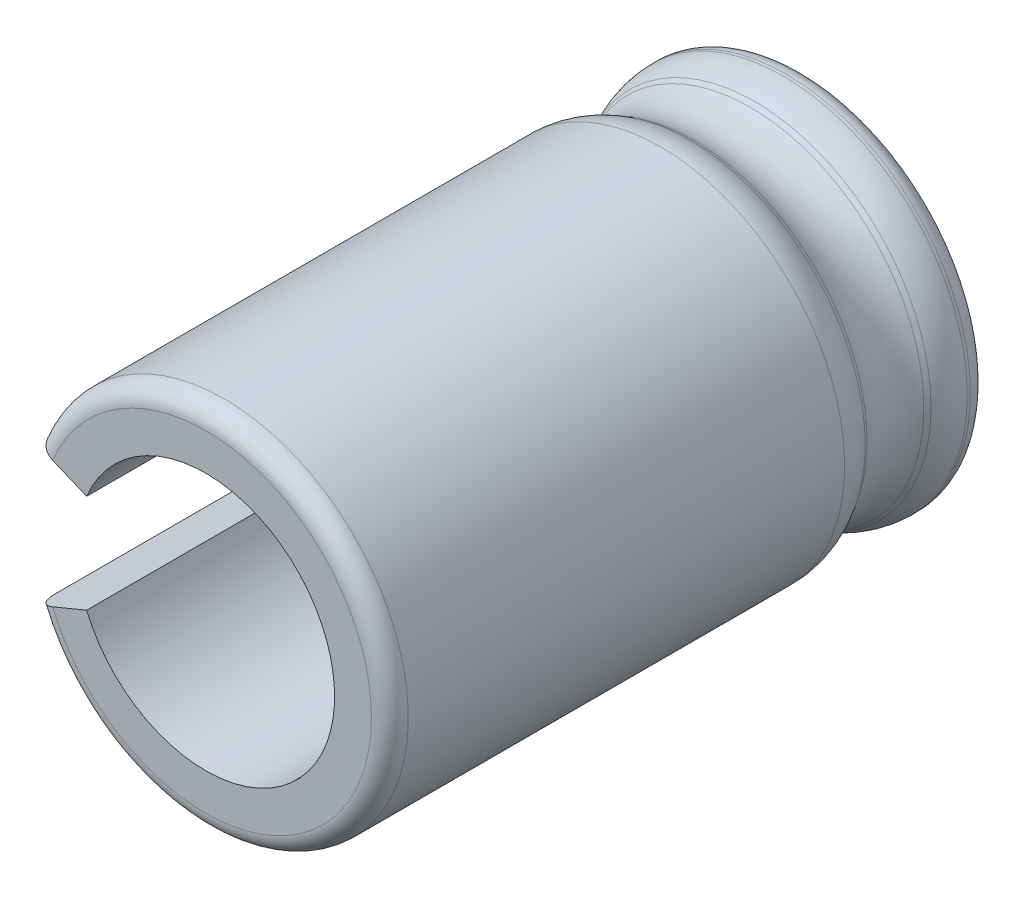
ISO-10303-21;
HEADER;
FILE_DESCRIPTION(('STEP AP214'),'2;1');
FILE_NAME('part.step','',(''),(''),'','','');
FILE_SCHEMA(('AUTOMOTIVE_DESIGN { 1 0 10303 214 1 1 1 1 }'));
ENDSEC;
DATA;
#1=APPLICATION_CONTEXT('core data for automotive mechanical design processes');
#2=APPLICATION_PROTOCOL_DEFINITION('international standard','automotive_design',2000,#1);
#3=PRODUCT_CONTEXT('',#1,'mechanical');
#4=PRODUCT('Part','Part','',(#3));
#5=PRODUCT_RELATED_PRODUCT_CATEGORY('part','',(#4));
#6=PRODUCT_DEFINITION_FORMATION('','',#4);
#7=PRODUCT_DEFINITION_CONTEXT('part definition',#1,'design');
#8=PRODUCT_DEFINITION('design','',#6,#7);
#9=PRODUCT_DEFINITION_SHAPE('','',#8);
#10=(LENGTH_UNIT() NAMED_UNIT(*) SI_UNIT(.MILLI.,.METRE.));
#11=(NAMED_UNIT(*) PLANE_ANGLE_UNIT() SI_UNIT($,.RADIAN.));
#12=(NAMED_UNIT(*) SI_UNIT($,.STERADIAN.) SOLID_ANGLE_UNIT());
#13=UNCERTAINTY_MEASURE_WITH_UNIT(LENGTH_MEASURE(1.E-05),#10,'distance_accuracy_value','');
#14=(GEOMETRIC_REPRESENTATION_CONTEXT(3) GLOBAL_UNCERTAINTY_ASSIGNED_CONTEXT((#13)) GLOBAL_UNIT_ASSIGNED_CONTEXT((#10,
#11,#12)) REPRESENTATION_CONTEXT('',''));
#15=CARTESIAN_POINT('',(0.,0.,0.));
#16=DIRECTION('',(0.,0.,1.));
#17=DIRECTION('',(1.,0.,0.));
#18=AXIS2_PLACEMENT_3D('',#15,#16,#17);
#19=CARTESIAN_POINT('',(0.,0.,0.42));
#20=DIRECTION('',(0.,0.,1.));
#21=DIRECTION('',(1.,0.,0.));
#22=AXIS2_PLACEMENT_3D('',#19,#20,#21);
#23=CYLINDRICAL_SURFACE('',#22,5.25);
#24=DIRECTION('',(0.,0.,1.));
#25=VECTOR('',#24,1.);
#26=CARTESIAN_POINT('',(-4.85036754568426,-2.00908801991671,0.42));
#27=LINE('',#26,#25);
#28=CARTESIAN_POINT('',(-4.85036754568426,-2.00908801991671,1.03375025520622));
#29=VERTEX_POINT('',#28);
#30=CARTESIAN_POINT('',(-4.85036754568426,-2.00908801991671,0.945));
#31=VERTEX_POINT('',#30);
#32=EDGE_CURVE('E102',#29,#31,#27,.F.);
#33=ORIENTED_EDGE('',*,*,#32,.T.);
#34=CARTESIAN_POINT('',(0.,0.,0.945));
#35=DIRECTION('',(0.,0.,1.));
#36=DIRECTION('',(1.,0.,0.));
#37=AXIS2_PLACEMENT_3D('',#34,#35,#36);
#38=CIRCLE('',#37,5.25);
#39=CARTESIAN_POINT('',(-4.85036754568426,2.00908801991671,0.945));
#40=VERTEX_POINT('',#39);
#41=EDGE_CURVE('E118',#40,#31,#38,.F.);
#42=ORIENTED_EDGE('',*,*,#41,.F.);
#43=DIRECTION('',(0.,0.,1.));
#44=VECTOR('',#43,1.);
#45=CARTESIAN_POINT('',(-4.85036754568426,2.00908801991671,0.42));
#46=LINE('',#45,#44);
#47=CARTESIAN_POINT('',(-4.85036754568426,2.00908801991671,1.03375025520622));
#48=VERTEX_POINT('',#47);
#49=EDGE_CURVE('E108',#40,#48,#46,.T.);
#50=ORIENTED_EDGE('',*,*,#49,.T.);
#51=CARTESIAN_POINT('',(0.,0.,1.03375025520622));
#52=DIRECTION('',(0.,0.,-1.));
#53=DIRECTION('',(1.,0.,0.));
#54=AXIS2_PLACEMENT_3D('',#51,#52,#53);
#55=CIRCLE('',#54,5.25);
#56=EDGE_CURVE('E159',#29,#48,#55,.F.);
#57=ORIENTED_EDGE('',*,*,#56,.F.);
#58=EDGE_LOOP('',(#33,#42,#50,#57));
#59=FACE_BOUND('',#58,.T.);
#60=ADVANCED_FACE('F17',(#59),#23,.T.);
#61=CARTESIAN_POINT('',(0.,0.,0.945));
#62=DIRECTION('',(0.,0.,1.));
#63=DIRECTION('',(1.,0.,0.));
#64=AXIS2_PLACEMENT_3D('',#61,#62,#63);
#65=TOROIDAL_SURFACE('',#64,4.725,0.525);
#66=CARTESIAN_POINT('',(-4.85036754568426,-2.00908801991671,0.945));
#67=CARTESIAN_POINT('',(-4.85039072116002,-2.00909761951308,0.915464391405059));
#68=CARTESIAN_POINT('',(-4.84806622229642,-2.00813478055806,0.885936277537769));
#69=CARTESIAN_POINT('',(-4.83889289537986,-2.00433506413714,0.827737923886833));
#70=CARTESIAN_POINT('',(-4.83204761711794,-2.00149965704285,0.799067029448648));
#71=CARTESIAN_POINT('',(-4.81399892411026,-1.99402364361596,0.743363719677459));
#72=CARTESIAN_POINT('',(-4.80279341672496,-1.98938217048369,0.716332098305048));
#73=CARTESIAN_POINT('',(-4.77635212953041,-1.9784298307211,0.664693094464665));
#74=CARTESIAN_POINT('',(-4.76111705970481,-1.97211925817564,0.640085285983271));
#75=CARTESIAN_POINT('',(-4.72704476589315,-1.95800605197769,0.593985045585103));
#76=CARTESIAN_POINT('',(-4.70820719582776,-1.95020327497445,0.572492913329232));
#77=CARTESIAN_POINT('',(-4.66746560106759,-1.93332755387208,0.533237078711865));
#78=CARTESIAN_POINT('',(-4.64556162580989,-1.92425463025045,0.515473316252535));
#79=CARTESIAN_POINT('',(-4.59930486040365,-1.90509445066768,0.484173774991626));
#80=CARTESIAN_POINT('',(-4.57495133392578,-1.89500688970893,0.470639272546676));
#81=CARTESIAN_POINT('',(-4.52449545169203,-1.87410737898621,0.448194865945521));
#82=CARTESIAN_POINT('',(-4.49839413036681,-1.86329585769745,0.439282253171321));
#83=CARTESIAN_POINT('',(-4.45433269969836,-1.84504501553701,0.428549553120101));
#84=CARTESIAN_POINT('',(-4.43664976944949,-1.83772050600544,0.425345407947885));
#85=CARTESIAN_POINT('',(-4.40109062734295,-1.82299142707856,0.421070913483755));
#86=CARTESIAN_POINT('',(-4.38321472577348,-1.81558698620883,0.419997539157893));
#87=CARTESIAN_POINT('',(-4.36533079111584,-1.80817921792504,0.42));
#88=B_SPLINE_CURVE_WITH_KNOTS('',3,(#66,#67,#68,#69,#70,#71,#72,#73,#74,#75,#76,#77,#78,#79,#80,
#81,#82,#83,#84,#85,#86,#87),.UNSPECIFIED.,.F.,.F.,(4,2,2,2,2,2,2,2,2,2,4),(0.,
0.088489114357564,0.176908828074504,0.265371030215084,0.353817656241403,0.442272783291248,
0.530726484417659,0.619206854434946,0.707635312539519,0.765743495319774,0.823769123330239),.UNSPECIFIED.);
#89=CARTESIAN_POINT('',(-4.36533079111583,-1.80817921792504,0.419999999999999));
#90=VERTEX_POINT('',#89);
#91=EDGE_CURVE('E121',#31,#90,#88,.T.);
#92=ORIENTED_EDGE('',*,*,#91,.T.);
#93=CARTESIAN_POINT('',(0.,0.,0.42));
#94=DIRECTION('',(0.,0.,1.));
#95=DIRECTION('',(-0.923879532511288,-0.382683432365088,0.));
#96=AXIS2_PLACEMENT_3D('',#93,#94,#95);
#97=CIRCLE('',#96,4.725);
#98=CARTESIAN_POINT('',(-4.36533079111583,1.80817921792504,0.419999999999999));
#99=VERTEX_POINT('',#98);
#100=EDGE_CURVE('E125',#90,#99,#97,.T.);
#101=ORIENTED_EDGE('',*,*,#100,.T.);
#102=CARTESIAN_POINT('',(-4.36533079111583,1.80817921792504,0.42));
#103=CARTESIAN_POINT('',(-4.39261813537696,1.81948200599915,0.419974915045805));
#104=CARTESIAN_POINT('',(-4.41989855541261,1.83078192596515,0.42249093448535));
#105=CARTESIAN_POINT('',(-4.47366682317657,1.85305347169828,0.432420071990567));
#106=CARTESIAN_POINT('',(-4.5001552757268,1.86402534799087,0.439829347790093));
#107=CARTESIAN_POINT('',(-4.55161842351754,1.8853420817682,0.459365112327077));
#108=CARTESIAN_POINT('',(-4.5765923852341,1.89568663541739,0.471493866121253));
#109=CARTESIAN_POINT('',(-4.6243006039615,1.91544802665094,0.500113709146317));
#110=CARTESIAN_POINT('',(-4.64703525455742,1.92486502726358,0.516604029896457));
#111=CARTESIAN_POINT('',(-4.68962632310514,1.94250682549201,0.55348361496427));
#112=CARTESIAN_POINT('',(-4.70948246420636,1.95073150843253,0.573873253875511));
#113=CARTESIAN_POINT('',(-4.74575012634099,1.96575406596426,0.617971638271388));
#114=CARTESIAN_POINT('',(-4.76216170289756,1.97255196355392,0.641680330245722));
#115=CARTESIAN_POINT('',(-4.79107870844551,1.9845297794351,0.691748292332195));
#116=CARTESIAN_POINT('',(-4.80358295823712,1.98970920928608,0.718108359441449));
#117=CARTESIAN_POINT('',(-4.82431888611529,1.99829831184161,0.772721412830135));
#118=CARTESIAN_POINT('',(-4.83255306663858,2.00170902108938,0.800973279449882));
#119=CARTESIAN_POINT('',(-4.84246878854448,2.00581624758352,0.84866502833913));
#120=CARTESIAN_POINT('',(-4.84542903268828,2.00704242085582,0.867804894118823));
#121=CARTESIAN_POINT('',(-4.84937815063553,2.00867819906899,0.906293832184031));
#122=CARTESIAN_POINT('',(-4.85036981920591,2.00908896164022,0.925642568616026));
#123=CARTESIAN_POINT('',(-4.85036754568426,2.00908801991672,0.944999999999993));
#124=B_SPLINE_CURVE_WITH_KNOTS('',3,(#102,#103,#104,#105,#106,#107,#108,#109,#110,#111,#112,
#113,#114,#115,#116,#117,#118,#119,#120,#121,#122,#123),.UNSPECIFIED.,.F.,.F.,(4,2,2,2,2,2,2,2,
2,2,4),(0.,0.0884891143575641,0.176908828074504,0.265371030215085,0.353817656241405,
0.442272783291249,0.53072648441766,0.619206854434946,0.707635312539518,0.765743495319774,
0.823769123330239),.UNSPECIFIED.);
#125=EDGE_CURVE('E111',#99,#40,#124,.T.);
#126=ORIENTED_EDGE('',*,*,#125,.T.);
#127=ORIENTED_EDGE('',*,*,#41,.T.);
#128=EDGE_LOOP('',(#92,#101,#126,#127));
#129=FACE_BOUND('',#128,.T.);
#130=ADVANCED_FACE('F123',(#129),#65,.T.);
#131=CARTESIAN_POINT('',(0.,0.,1.03375025520622));
#132=DIRECTION('',(0.,0.,-1.));
#133=DIRECTION('',(1.,0.,0.));
#134=AXIS2_PLACEMENT_3D('',#131,#132,#133);
#135=TOROIDAL_SURFACE('',#134,3.675,1.575);
#136=CARTESIAN_POINT('',(-4.6430040392502,-1.92319524321049,1.84408106998251));
#137=CARTESIAN_POINT('',(-4.6642930980392,-1.93201346009105,1.80567264401115));
#138=CARTESIAN_POINT('',(-4.68405717686441,-1.94020000958826,1.76630490989179));
#139=CARTESIAN_POINT('',(-4.72042309678055,-1.9552632668257,1.6858823007809));
#140=CARTESIAN_POINT('',(-4.73702417512244,-1.96213965862493,1.64482702173695));
#141=CARTESIAN_POINT('',(-4.78120533193521,-1.98044009297811,1.52144596809976));
#142=CARTESIAN_POINT('',(-4.80415967611481,-1.98994809365269,1.43709672178333));
#143=CARTESIAN_POINT('',(-4.83034396301765,-2.00079398040891,1.29949087476157));
#144=CARTESIAN_POINT('',(-4.83778357186439,-2.00387556729198,1.24711280320819));
#145=CARTESIAN_POINT('',(-4.84782961323955,-2.00803677387773,1.14108991509009));
#146=CARTESIAN_POINT('',(-4.8503683474684,-2.00908835202658,1.08743757789838));
#147=CARTESIAN_POINT('',(-4.85036754568426,-2.00908801991672,1.03375025520623));
#148=B_SPLINE_CURVE_WITH_KNOTS('',3,(#136,#137,#138,#139,#140,#141,#142,#143,#144,#145,#146,
#147),.UNSPECIFIED.,.F.,.F.,(4,2,2,2,2,4),(0.,0.134277866281074,0.268588072437448,
0.530970445713372,0.689715228986294,0.850637571564519),.UNSPECIFIED.);
#149=CARTESIAN_POINT('',(-4.64300403926542,-1.92319524320921,1.84408106997915));
#150=VERTEX_POINT('',#149);
#151=EDGE_CURVE('E166',#150,#29,#148,.T.);
#152=ORIENTED_EDGE('',*,*,#151,.T.);
#153=ORIENTED_EDGE('',*,*,#56,.T.);
#154=CARTESIAN_POINT('',(-4.85036754568426,2.00908801991671,1.03375025520622));
#155=CARTESIAN_POINT('',(-4.8503660052936,2.00908738186601,1.07854079166082));
#156=CARTESIAN_POINT('',(-4.84860081541753,2.00835621627918,1.12330468777989));
#157=CARTESIAN_POINT('',(-4.8415568869684,2.00543852558317,1.2125181848482));
#158=CARTESIAN_POINT('',(-4.83627730228437,2.00325165000334,1.25696770750513));
#159=CARTESIAN_POINT('',(-4.81551535662384,1.9946517705295,1.38736996437547));
#160=CARTESIAN_POINT('',(-4.79510464015692,1.98619737495115,1.47248180371879));
#161=CARTESIAN_POINT('',(-4.75214900498053,1.96840456828074,1.60505951192081));
#162=CARTESIAN_POINT('',(-4.73363143829658,1.9607343410181,1.6541163531869));
#163=CARTESIAN_POINT('',(-4.6918497658631,1.94342780563752,1.75062473144622));
#164=CARTESIAN_POINT('',(-4.66852403450519,1.9337659713568,1.7980450170756));
#165=CARTESIAN_POINT('',(-4.64300403925021,1.92319524321049,1.8440810699825));
#166=B_SPLINE_CURVE_WITH_KNOTS('',3,(#154,#155,#156,#157,#158,#159,#160,#161,#162,#163,#164,
#165),.UNSPECIFIED.,.F.,.F.,(4,2,2,2,2,4),(0.,0.134277866281075,0.268588072437449,
0.530970445713373,0.689715228986294,0.85063757156452),.UNSPECIFIED.);
#167=CARTESIAN_POINT('',(-4.64300403926542,1.92319524320922,1.84408106997915));
#168=VERTEX_POINT('',#167);
#169=EDGE_CURVE('E114',#48,#168,#166,.T.);
#170=ORIENTED_EDGE('',*,*,#169,.T.);
#171=CARTESIAN_POINT('',(0.,0.,1.8440810699758));
#172=DIRECTION('',(0.,0.,-1.));
#173=DIRECTION('',(-1.,0.,0.));
#174=AXIS2_PLACEMENT_3D('',#171,#172,#173);
#175=CIRCLE('',#174,5.02555135801686);
#176=EDGE_CURVE('E155',#150,#168,#175,.F.);
#177=ORIENTED_EDGE('',*,*,#176,.F.);
#178=EDGE_LOOP('',(#152,#153,#170,#177));
#179=FACE_BOUND('',#178,.T.);
#180=ADVANCED_FACE('F146',(#179),#135,.T.);
#181=CARTESIAN_POINT('',(0.,0.,0.42));
#182=DIRECTION('',(0.,0.,1.));
#183=DIRECTION('',(1.,0.,0.));
#184=AXIS2_PLACEMENT_3D('',#181,#182,#183);
#185=PLANE('',#184);
#186=ORIENTED_EDGE('',*,*,#100,.F.);
#187=DIRECTION('',(-0.923879532511288,-0.382683432365087,0.));
#188=VECTOR('',#187,1.);
#189=CARTESIAN_POINT('',(-3.39525728197898,-1.4063616139417,0.42));
#190=LINE('',#189,#188);
#191=CARTESIAN_POINT('',(-3.39525728197898,-1.4063616139417,0.419999999999998));
#192=VERTEX_POINT('',#191);
#193=EDGE_CURVE('E165',#192,#90,#190,.T.);
#194=ORIENTED_EDGE('',*,*,#193,.F.);
#195=CARTESIAN_POINT('',(0.,0.,0.419999999999998));
#196=DIRECTION('',(0.,0.,1.));
#197=DIRECTION('',(1.,0.,0.));
#198=AXIS2_PLACEMENT_3D('',#195,#196,#197);
#199=CIRCLE('',#198,3.675);
#200=CARTESIAN_POINT('',(-3.39525728197898,1.4063616139417,0.419999999999998));
#201=VERTEX_POINT('',#200);
#202=EDGE_CURVE('E287',#192,#201,#199,.T.);
#203=ORIENTED_EDGE('',*,*,#202,.T.);
#204=DIRECTION('',(0.923879532511288,-0.382683432365087,0.));
#205=VECTOR('',#204,1.);
#206=CARTESIAN_POINT('',(-4.36533079111583,1.80817921792504,0.42));
#207=LINE('',#206,#205);
#208=EDGE_CURVE('E241',#99,#201,#207,.T.);
#209=ORIENTED_EDGE('',*,*,#208,.F.);
#210=EDGE_LOOP('',(#186,#194,#203,#209));
#211=FACE_BOUND('',#210,.T.);
#212=ADVANCED_FACE('F250',(#211),#185,.F.);
#213=CARTESIAN_POINT('',(0.,0.,1.8440810699758));
#214=DIRECTION('',(0.,0.,-1.));
#215=DIRECTION('',(-1.,0.,0.));
#216=AXIS2_PLACEMENT_3D('',#213,#214,#215);
#217=CONICAL_SURFACE('',#216,5.02555135801686,0.540419500335847);
#218=DIRECTION('',(0.475332098003425,0.196889001624275,0.857492925712544));
#219=VECTOR('',#218,1.);
#220=CARTESIAN_POINT('',(-276615.197263173,-114577.766264915,-499000.));
#221=LINE('',#220,#219);
#222=CARTESIAN_POINT('',(-4.57200124648011,-1.89378492347292,1.97216918516948));
#223=VERTEX_POINT('',#222);
#224=EDGE_CURVE('E240',#223,#150,#221,.F.);
#225=ORIENTED_EDGE('',*,*,#224,.T.);
#226=ORIENTED_EDGE('',*,*,#176,.T.);
#227=DIRECTION('',(0.475332098003425,-0.196889001624275,0.857492925712544));
#228=VECTOR('',#227,1.);
#229=CARTESIAN_POINT('',(-276615.197263173,114577.766264915,-499000.));
#230=LINE('',#229,#228);
#231=CARTESIAN_POINT('',(-4.57200124648011,1.89378492347292,1.97216918516948));
#232=VERTEX_POINT('',#231);
#233=EDGE_CURVE('E238',#168,#232,#230,.T.);
#234=ORIENTED_EDGE('',*,*,#233,.T.);
#235=CARTESIAN_POINT('',(0.,0.,1.97216918520165));
#236=DIRECTION('',(0.,0.,-1.));
#237=DIRECTION('',(1.,0.,0.));
#238=AXIS2_PLACEMENT_3D('',#235,#236,#237);
#239=CIRCLE('',#238,4.94869848887901);
#240=EDGE_CURVE('E307',#232,#223,#239,.T.);
#241=ORIENTED_EDGE('',*,*,#240,.T.);
#242=EDGE_LOOP('',(#225,#226,#234,#241));
#243=FACE_BOUND('',#242,.T.);
#244=ADVANCED_FACE('F259',(#243),#217,.T.);
#245=CARTESIAN_POINT('',(0.,0.,17.5));
#246=DIRECTION('',(0.,0.,1.));
#247=DIRECTION('',(1.,0.,0.));
#248=AXIS2_PLACEMENT_3D('',#245,#246,#247);
#249=PLANE('',#248);
#250=DIRECTION('',(-0.923879532511288,-0.382683432365087,0.));
#251=VECTOR('',#250,1.);
#252=CARTESIAN_POINT('',(-3.39525728197898,-1.4063616139417,17.5));
#253=LINE('',#252,#251);
#254=CARTESIAN_POINT('',(-3.39525728197898,-1.4063616139417,17.5));
#255=VERTEX_POINT('',#254);
#256=CARTESIAN_POINT('',(-4.36533079111583,-1.80817921792504,17.5));
#257=VERTEX_POINT('',#256);
#258=EDGE_CURVE('E277',#255,#257,#253,.T.);
#259=ORIENTED_EDGE('',*,*,#258,.T.);
#260=CARTESIAN_POINT('',(0.,0.,17.5));
#261=DIRECTION('',(0.,0.,-1.));
#262=DIRECTION('',(-0.923879532511288,0.382683432365088,0.));
#263=AXIS2_PLACEMENT_3D('',#260,#261,#262);
#264=CIRCLE('',#263,4.725);
#265=CARTESIAN_POINT('',(-4.36533079111583,1.80817921792504,17.5));
#266=VERTEX_POINT('',#265);
#267=EDGE_CURVE('E346',#266,#257,#264,.T.);
#268=ORIENTED_EDGE('',*,*,#267,.F.);
#269=DIRECTION('',(-0.923879532511287,0.38268343236509,0.));
#270=VECTOR('',#269,1.);
#271=CARTESIAN_POINT('',(-14.5,6.00609665440987,17.5));
#272=LINE('',#271,#270);
#273=CARTESIAN_POINT('',(-3.39525728197898,1.4063616139417,17.5));
#274=VERTEX_POINT('',#273);
#275=EDGE_CURVE('E237',#266,#274,#272,.F.);
#276=ORIENTED_EDGE('',*,*,#275,.T.);
#277=CARTESIAN_POINT('',(0.,0.,17.5));
#278=DIRECTION('',(0.,0.,1.));
#279=DIRECTION('',(1.,0.,0.));
#280=AXIS2_PLACEMENT_3D('',#277,#278,#279);
#281=CIRCLE('',#280,3.675);
#282=EDGE_CURVE('E284',#274,#255,#281,.F.);
#283=ORIENTED_EDGE('',*,*,#282,.T.);
#284=EDGE_LOOP('',(#259,#268,#276,#283));
#285=FACE_BOUND('',#284,.T.);
#286=ADVANCED_FACE('F262',(#285),#249,.T.);
#287=CARTESIAN_POINT('',(0.,0.,-5.13241922552691));
#288=DIRECTION('',(0.,0.,1.));
#289=DIRECTION('',(1.,0.,0.));
#290=AXIS2_PLACEMENT_3D('',#287,#288,#289);
#291=CYLINDRICAL_SURFACE('',#290,3.675);
#292=ORIENTED_EDGE('',*,*,#202,.F.);
#293=DIRECTION('',(0.,0.,1.));
#294=VECTOR('',#293,1.);
#295=CARTESIAN_POINT('',(-3.39525728197898,-1.4063616139417,-45.3484697372341));
#296=LINE('',#295,#294);
#297=EDGE_CURVE('E352',#192,#255,#296,.T.);
#298=ORIENTED_EDGE('',*,*,#297,.T.);
#299=ORIENTED_EDGE('',*,*,#282,.F.);
#300=DIRECTION('',(0.,0.,1.));
#301=VECTOR('',#300,1.);
#302=CARTESIAN_POINT('',(-3.39525728197898,1.4063616139417,-45.3484697372341));
#303=LINE('',#302,#301);
#304=EDGE_CURVE('E228',#274,#201,#303,.F.);
#305=ORIENTED_EDGE('',*,*,#304,.T.);
#306=EDGE_LOOP('',(#292,#298,#299,#305));
#307=FACE_BOUND('',#306,.T.);
#308=ADVANCED_FACE('F267',(#307),#291,.F.);
#309=CARTESIAN_POINT('',(0.,0.,2.7825));
#310=DIRECTION('',(0.,0.,-1.));
#311=DIRECTION('',(1.,0.,0.));
#312=AXIS2_PLACEMENT_3D('',#309,#310,#311);
#313=TOROIDAL_SURFACE('',#312,6.29924984687627,1.575);
#314=CARTESIAN_POINT('',(0.,0.,3.59283081479589));
#315=DIRECTION('',(0.,0.,1.));
#316=DIRECTION('',(-1.,0.,0.));
#317=AXIS2_PLACEMENT_3D('',#314,#315,#316);
#318=CIRCLE('',#317,4.94869848887447);
#319=CARTESIAN_POINT('',(-4.57200124644276,-1.89378492346328,3.59283081479712));
#320=VERTEX_POINT('',#319);
#321=CARTESIAN_POINT('',(-4.57200124644391,1.89378492346375,3.59283081479665));
#322=VERTEX_POINT('',#321);
#323=EDGE_CURVE('E314',#320,#322,#318,.T.);
#324=ORIENTED_EDGE('',*,*,#323,.F.);
#325=CARTESIAN_POINT('',(-4.57200124644433,-1.89378492346393,3.5928308147974));
#326=CARTESIAN_POINT('',(-4.55093515448218,-1.88505906246701,3.55482724904516));
#327=CARTESIAN_POINT('',(-4.53136157275592,-1.87695141945177,3.51587916441506));
#328=CARTESIAN_POINT('',(-4.49531475325362,-1.86202033793351,3.43633928581824));
#329=CARTESIAN_POINT('',(-4.47884136811826,-1.85519683839224,3.39574757008852));
#330=CARTESIAN_POINT('',(-4.43430005042165,-1.83674722051634,3.27203149845142));
#331=CARTESIAN_POINT('',(-4.41102736952864,-1.82710736045767,3.1868150806526));
#332=CARTESIAN_POINT('',(-4.3780295520998,-1.81343921694993,3.01337536711703));
#333=CARTESIAN_POINT('',(-4.36830948583725,-1.80941303367682,2.92515095867636));
#334=CARTESIAN_POINT('',(-4.36268631730649,-1.80708384100787,2.74814278282857));
#335=CARTESIAN_POINT('',(-4.36678806541628,-1.80878284070439,2.65935882997643));
#336=CARTESIAN_POINT('',(-4.38870850344874,-1.81786258343059,2.48374311473381));
#337=CARTESIAN_POINT('',(-4.40653744544027,-1.82524757300624,2.39691286135825));
#338=CARTESIAN_POINT('',(-4.45540445468333,-1.84548895098733,2.22785223157009));
#339=CARTESIAN_POINT('',(-4.48641809571376,-1.8583352217207,2.1456136656671));
#340=CARTESIAN_POINT('',(-4.53868306573285,-1.87998408113964,2.03467500150892));
#341=CARTESIAN_POINT('',(-4.55485093830922,-1.88668103323549,2.00309135113074));
#342=CARTESIAN_POINT('',(-4.5720012464558,-1.89378492346868,1.9721691851819));
#343=B_SPLINE_CURVE_WITH_KNOTS('',3,(#325,#326,#327,#328,#329,#330,#331,#332,#333,#334,#335,
#336,#337,#338,#339,#340,#341,#342),.UNSPECIFIED.,.F.,.F.,(4,2,2,2,2,2,2,2,4),(0.,
0.13287591969783,0.265745521907447,0.53096301060887,0.796279695273061,1.06168949507938,
1.32729770703763,1.5924159779919,1.70064738323639),.UNSPECIFIED.);
#344=EDGE_CURVE('E193',#320,#223,#343,.T.);
#345=ORIENTED_EDGE('',*,*,#344,.T.);
#346=ORIENTED_EDGE('',*,*,#240,.F.);
#347=CARTESIAN_POINT('',(-4.5720012464558,1.89378492346868,1.9721691851819));
#348=CARTESIAN_POINT('',(-4.55093515449312,1.88505906247154,2.01017275093379));
#349=CARTESIAN_POINT('',(-4.5313615727663,1.87695141945607,2.04912083556357));
#350=CARTESIAN_POINT('',(-4.49531475326288,1.86202033793734,2.12866071415979));
#351=CARTESIAN_POINT('',(-4.47884136812694,1.85519683839584,2.16925242988923));
#352=CARTESIAN_POINT('',(-4.43430005042858,1.83674722051921,2.2929685015256));
#353=CARTESIAN_POINT('',(-4.41102736953436,1.82710736046004,2.37818491932403));
#354=CARTESIAN_POINT('',(-4.37802955210307,1.81343921695129,2.55162463285906));
#355=CARTESIAN_POINT('',(-4.36830948583927,1.80941303367766,2.63984904129956));
#356=CARTESIAN_POINT('',(-4.362686317306,1.80708384100767,2.81685721714726));
#357=CARTESIAN_POINT('',(-4.36678806541454,1.80878284070366,2.90564116999947));
#358=CARTESIAN_POINT('',(-4.38870850344451,1.81786258342884,3.08125688524245));
#359=CARTESIAN_POINT('',(-4.4065374454348,1.82524757300398,3.16808713861831));
#360=CARTESIAN_POINT('',(-4.45540445467548,1.84548895098408,3.33714776840728));
#361=CARTESIAN_POINT('',(-4.48641809570474,1.85833522171697,3.41938633431079));
#362=CARTESIAN_POINT('',(-4.53868306572226,1.87998408113525,3.53032499846983));
#363=CARTESIAN_POINT('',(-4.55485093829819,1.88668103323092,3.56190864884828));
#364=CARTESIAN_POINT('',(-4.57200124644433,1.89378492346393,3.5928308147974));
#365=B_SPLINE_CURVE_WITH_KNOTS('',3,(#347,#348,#349,#350,#351,#352,#353,#354,#355,#356,#357,
#358,#359,#360,#361,#362,#363,#364),.UNSPECIFIED.,.F.,.F.,(4,2,2,2,2,2,2,2,4),(0.,
0.132875919697831,0.265745521907447,0.530963010608871,0.796279695273063,1.06168949507938,
1.32729770703763,1.5924159779919,1.70064738323639),.UNSPECIFIED.);
#366=EDGE_CURVE('E308',#232,#322,#365,.T.);
#367=ORIENTED_EDGE('',*,*,#366,.T.);
#368=EDGE_LOOP('',(#324,#345,#346,#367));
#369=FACE_BOUND('',#368,.T.);
#370=ADVANCED_FACE('F320',(#369),#313,.F.);
#371=CARTESIAN_POINT('',(0.,0.,3.72091893001425));
#372=DIRECTION('',(0.,0.,1.));
#373=DIRECTION('',(0.,-1.,0.));
#374=AXIS2_PLACEMENT_3D('',#371,#372,#373);
#375=CONICAL_SURFACE('',#374,5.02555135801686,0.540419500335847);
#376=DIRECTION('',(0.475332098003411,0.196889001624268,-0.857492925712553));
#377=VECTOR('',#376,1.);
#378=CARTESIAN_POINT('',(-4.64300403923797,-1.92319524320542,3.72091892999543));
#379=LINE('',#378,#377);
#380=CARTESIAN_POINT('',(-4.64300403923797,-1.92319524320542,3.72091892999543));
#381=VERTEX_POINT('',#380);
#382=EDGE_CURVE('E190',#381,#320,#379,.T.);
#383=ORIENTED_EDGE('',*,*,#382,.T.);
#384=ORIENTED_EDGE('',*,*,#323,.T.);
#385=DIRECTION('',(-0.475332098003411,0.196889001624268,0.857492925712553));
#386=VECTOR('',#385,1.);
#387=CARTESIAN_POINT('',(-4.57200124644486,1.89378492346415,3.59283081479836));
#388=LINE('',#387,#386);
#389=CARTESIAN_POINT('',(-4.64300403923797,1.92319524320542,3.72091892999543));
#390=VERTEX_POINT('',#389);
#391=EDGE_CURVE('E313',#322,#390,#388,.T.);
#392=ORIENTED_EDGE('',*,*,#391,.T.);
#393=CARTESIAN_POINT('',(0.,0.,3.72091892999543));
#394=DIRECTION('',(0.,0.,1.));
#395=DIRECTION('',(1.,0.,0.));
#396=AXIS2_PLACEMENT_3D('',#393,#394,#395);
#397=CIRCLE('',#396,5.02555135799726);
#398=EDGE_CURVE('E173',#381,#390,#397,.T.);
#399=ORIENTED_EDGE('',*,*,#398,.F.);
#400=EDGE_LOOP('',(#383,#384,#392,#399));
#401=FACE_BOUND('',#400,.T.);
#402=ADVANCED_FACE('F324',(#401),#375,.T.);
#403=CARTESIAN_POINT('',(-14.5,6.00609665440987,-45.3484697372341));
#404=DIRECTION('',(0.38268343236509,0.923879532511287,0.));
#405=DIRECTION('',(-0.923879532511287,0.38268343236509,0.));
#406=AXIS2_PLACEMENT_3D('',#403,#404,#405);
#407=PLANE('',#406);
#408=ORIENTED_EDGE('',*,*,#208,.T.);
#409=ORIENTED_EDGE('',*,*,#304,.F.);
#410=ORIENTED_EDGE('',*,*,#275,.F.);
#411=CARTESIAN_POINT('',(-4.85036754568426,2.00908801991671,16.975));
#412=CARTESIAN_POINT('',(-4.85039072116002,2.00909761951308,17.0045356085949));
#413=CARTESIAN_POINT('',(-4.84806622229642,2.00813478055806,17.0340637224622));
#414=CARTESIAN_POINT('',(-4.83889289537986,2.00433506413714,17.0922620761132));
#415=CARTESIAN_POINT('',(-4.83204761711794,2.00149965704284,17.1209329705514));
#416=CARTESIAN_POINT('',(-4.81399892411026,1.99402364361596,17.1766362803225));
#417=CARTESIAN_POINT('',(-4.80279341672496,1.98938217048369,17.2036679016949));
#418=CARTESIAN_POINT('',(-4.77635212953041,1.9784298307211,17.2553069055353));
#419=CARTESIAN_POINT('',(-4.76111705970481,1.97211925817564,17.2799147140167));
#420=CARTESIAN_POINT('',(-4.72704476589315,1.95800605197769,17.3260149544149));
#421=CARTESIAN_POINT('',(-4.70820719582776,1.95020327497445,17.3475070866708));
#422=CARTESIAN_POINT('',(-4.6674656010676,1.93332755387208,17.3867629212881));
#423=CARTESIAN_POINT('',(-4.6455616258099,1.92425463025046,17.4045266837475));
#424=CARTESIAN_POINT('',(-4.59930486040365,1.90509445066768,17.4358262250084));
#425=CARTESIAN_POINT('',(-4.57495133392579,1.89500688970893,17.4493607274533));
#426=CARTESIAN_POINT('',(-4.52449545169203,1.87410737898621,17.4718051340545));
#427=CARTESIAN_POINT('',(-4.49839413036681,1.86329585769745,17.4807177468287));
#428=CARTESIAN_POINT('',(-4.45433269969836,1.84504501553702,17.4914504468799));
#429=CARTESIAN_POINT('',(-4.43664976944949,1.83772050600544,17.4946545920521));
#430=CARTESIAN_POINT('',(-4.40109062734295,1.82299142707855,17.4989290865162));
#431=CARTESIAN_POINT('',(-4.38321472577348,1.81558698620883,17.5000024608421));
#432=CARTESIAN_POINT('',(-4.36533079111584,1.80817921792504,17.5));
#433=B_SPLINE_CURVE_WITH_KNOTS('',3,(#411,#412,#413,#414,#415,#416,#417,#418,#419,#420,#421,
#422,#423,#424,#425,#426,#427,#428,#429,#430,#431,#432),.UNSPECIFIED.,.F.,.F.,(4,2,2,2,2,2,2,2,
2,2,4),(0.,0.0884891143575613,0.1769088280745,0.26537103021508,0.353817656241398,
0.442272783291242,0.530726484417655,0.619206854434943,0.707635312539517,0.765743495319774,
0.82376912333024),.UNSPECIFIED.);
#434=CARTESIAN_POINT('',(-4.85036754568426,2.00908801991671,16.975));
#435=VERTEX_POINT('',#434);
#436=EDGE_CURVE('E236',#435,#266,#433,.T.);
#437=ORIENTED_EDGE('',*,*,#436,.F.);
#438=DIRECTION('',(0.,0.,1.));
#439=VECTOR('',#438,1.);
#440=CARTESIAN_POINT('',(-4.85036754568426,2.00908801991671,4.095));
#441=LINE('',#440,#439);
#442=CARTESIAN_POINT('',(-4.85036754568426,2.00908801991671,4.53124974479378));
#443=VERTEX_POINT('',#442);
#444=EDGE_CURVE('E198',#443,#435,#441,.T.);
#445=ORIENTED_EDGE('',*,*,#444,.F.);
#446=CARTESIAN_POINT('',(-4.64300403923797,1.92319524320542,3.72091892999543));
#447=CARTESIAN_POINT('',(-4.66429309802756,1.93201346008622,3.75932735596642));
#448=CARTESIAN_POINT('',(-4.68405717685337,1.94020000958369,3.79869509008545));
#449=CARTESIAN_POINT('',(-4.72042309677073,1.95526326682163,3.87911769919573));
#450=CARTESIAN_POINT('',(-4.73702417511325,1.96213965862112,3.9201729782394));
#451=CARTESIAN_POINT('',(-4.78120533192786,1.98044009297507,4.04355403187579));
#452=CARTESIAN_POINT('',(-4.80415967610873,1.98994809365016,4.12790327819178));
#453=CARTESIAN_POINT('',(-4.83034396301443,2.00079398040757,4.26550912521719));
#454=CARTESIAN_POINT('',(-4.83778357186236,2.00387556729113,4.31788719677466));
#455=CARTESIAN_POINT('',(-4.84782961323914,2.00803677387756,4.42391008490119));
#456=CARTESIAN_POINT('',(-4.8503683474684,2.00908835202658,4.47756242209725));
#457=CARTESIAN_POINT('',(-4.85036754568426,2.00908801991672,4.53124974479377));
#458=B_SPLINE_CURVE_WITH_KNOTS('',3,(#446,#447,#448,#449,#450,#451,#452,#453,#454,#455,#456,
#457),.UNSPECIFIED.,.F.,.F.,(4,2,2,2,2,4),(0.,0.134277866281123,0.268588072437538,
0.530970445713373,0.689715228998935,0.850637571590215),.UNSPECIFIED.);
#459=EDGE_CURVE('E174',#390,#443,#458,.T.);
#460=ORIENTED_EDGE('',*,*,#459,.F.);
#461=ORIENTED_EDGE('',*,*,#391,.F.);
#462=ORIENTED_EDGE('',*,*,#366,.F.);
#463=ORIENTED_EDGE('',*,*,#233,.F.);
#464=ORIENTED_EDGE('',*,*,#169,.F.);
#465=ORIENTED_EDGE('',*,*,#49,.F.);
#466=ORIENTED_EDGE('',*,*,#125,.F.);
#467=EDGE_LOOP('',(#408,#409,#410,#437,#445,#460,#461,#462,#463,#464,#465,#466));
#468=FACE_BOUND('',#467,.T.);
#469=ADVANCED_FACE('F109',(#468),#407,.F.);
#470=CARTESIAN_POINT('',(0.,0.,16.975));
#471=DIRECTION('',(0.,0.,-1.));
#472=DIRECTION('',(1.,0.,0.));
#473=AXIS2_PLACEMENT_3D('',#470,#471,#472);
#474=TOROIDAL_SURFACE('',#473,4.725,0.525);
#475=CARTESIAN_POINT('',(-4.36533079111583,-1.80817921792504,17.5));
#476=CARTESIAN_POINT('',(-4.39261813537696,-1.81948200599915,17.5000250849542));
#477=CARTESIAN_POINT('',(-4.41989855541261,-1.83078192596515,17.4975090655147));
#478=CARTESIAN_POINT('',(-4.47366682317657,-1.85305347169828,17.4875799280094));
#479=CARTESIAN_POINT('',(-4.5001552757268,-1.86402534799086,17.4801706522099));
#480=CARTESIAN_POINT('',(-4.55161842351753,-1.8853420817682,17.4606348876729));
#481=CARTESIAN_POINT('',(-4.5765923852341,-1.89568663541739,17.4485061338787));
#482=CARTESIAN_POINT('',(-4.6243006039615,-1.91544802665094,17.4198862908537));
#483=CARTESIAN_POINT('',(-4.64703525455742,-1.92486502726358,17.4033959701035));
#484=CARTESIAN_POINT('',(-4.68962632310514,-1.94250682549201,17.3665163850357));
#485=CARTESIAN_POINT('',(-4.70948246420636,-1.95073150843253,17.3461267461245));
#486=CARTESIAN_POINT('',(-4.745750126341,-1.96575406596426,17.3020283617286));
#487=CARTESIAN_POINT('',(-4.76216170289756,-1.97255196355392,17.2783196697543));
#488=CARTESIAN_POINT('',(-4.79107870844551,-1.98452977943509,17.2282517076678));
#489=CARTESIAN_POINT('',(-4.80358295823712,-1.98970920928608,17.2018916405586));
#490=CARTESIAN_POINT('',(-4.82431888611529,-1.99829831184161,17.1472785871699));
#491=CARTESIAN_POINT('',(-4.83255306663857,-2.00170902108938,17.1190267205501));
#492=CARTESIAN_POINT('',(-4.84246878854448,-2.00581624758353,17.0713349716609));
#493=CARTESIAN_POINT('',(-4.84542903268828,-2.00704242085583,17.0521951058812));
#494=CARTESIAN_POINT('',(-4.84937815063553,-2.00867819906898,17.013706167816));
#495=CARTESIAN_POINT('',(-4.85036981920591,-2.00908896164022,16.994357431384));
#496=CARTESIAN_POINT('',(-4.85036754568426,-2.00908801991672,16.975));
#497=B_SPLINE_CURVE_WITH_KNOTS('',3,(#475,#476,#477,#478,#479,#480,#481,#482,#483,#484,#485,
#486,#487,#488,#489,#490,#491,#492,#493,#494,#495,#496),.UNSPECIFIED.,.F.,.F.,(4,2,2,2,2,2,2,2,
2,2,4),(0.,0.0884891143575632,0.176908828074505,0.265371030215082,0.353817656241402,
0.442272783291249,0.530726484417661,0.619206854434948,0.70763531253952,0.765743495319777,
0.82376912333024),.UNSPECIFIED.);
#498=CARTESIAN_POINT('',(-4.85036754568426,-2.00908801991671,16.975));
#499=VERTEX_POINT('',#498);
#500=EDGE_CURVE('E194',#257,#499,#497,.T.);
#501=ORIENTED_EDGE('',*,*,#500,.T.);
#502=CARTESIAN_POINT('',(0.,0.,16.975));
#503=DIRECTION('',(0.,0.,1.));
#504=DIRECTION('',(1.,0.,0.));
#505=AXIS2_PLACEMENT_3D('',#502,#503,#504);
#506=CIRCLE('',#505,5.25);
#507=EDGE_CURVE('E195',#435,#499,#506,.F.);
#508=ORIENTED_EDGE('',*,*,#507,.F.);
#509=ORIENTED_EDGE('',*,*,#436,.T.);
#510=ORIENTED_EDGE('',*,*,#267,.T.);
#511=EDGE_LOOP('',(#501,#508,#509,#510));
#512=FACE_BOUND('',#511,.T.);
#513=ADVANCED_FACE('F204',(#512),#474,.T.);
#514=CARTESIAN_POINT('',(-14.5,-6.00609665440987,-45.3484697372341));
#515=DIRECTION('',(0.38268343236509,-0.923879532511287,0.));
#516=DIRECTION('',(0.923879532511287,0.38268343236509,0.));
#517=AXIS2_PLACEMENT_3D('',#514,#515,#516);
#518=PLANE('',#517);
#519=ORIENTED_EDGE('',*,*,#32,.F.);
#520=ORIENTED_EDGE('',*,*,#151,.F.);
#521=ORIENTED_EDGE('',*,*,#224,.F.);
#522=ORIENTED_EDGE('',*,*,#344,.F.);
#523=ORIENTED_EDGE('',*,*,#382,.F.);
#524=CARTESIAN_POINT('',(-4.85036754568426,-2.00908801991671,4.53124974479378));
#525=CARTESIAN_POINT('',(-4.8503660052936,-2.00908738186601,4.48645920833916));
#526=CARTESIAN_POINT('',(-4.84860081541752,-2.00835621627918,4.44169531222008));
#527=CARTESIAN_POINT('',(-4.84155688696839,-2.00543852558316,4.35248181515174));
#528=CARTESIAN_POINT('',(-4.83627730228436,-2.00325165000334,4.30803229249479));
#529=CARTESIAN_POINT('',(-4.81551535662383,-1.99465177052949,4.17763003562447));
#530=CARTESIAN_POINT('',(-4.79510464015691,-1.98619737495114,4.09251819628118));
#531=CARTESIAN_POINT('',(-4.75214900497924,-1.9684045682802,3.95994048807521));
#532=CARTESIAN_POINT('',(-4.73363143829363,-1.96073434101687,3.91088364680528));
#533=CARTESIAN_POINT('',(-4.69184976585607,-1.9434278056346,3.81437526853855));
#534=CARTESIAN_POINT('',(-4.66852403449573,-1.93376597135288,3.76695498290563));
#535=CARTESIAN_POINT('',(-4.64300403923798,-1.92319524320542,3.72091892999543));
#536=B_SPLINE_CURVE_WITH_KNOTS('',3,(#524,#525,#526,#527,#528,#529,#530,#531,#532,#533,#534,
#535),.UNSPECIFIED.,.F.,.F.,(4,2,2,2,2,4),(0.,0.134277866281122,0.268588072437538,
0.530970445713373,0.689715228998936,0.850637571590216),.UNSPECIFIED.);
#537=CARTESIAN_POINT('',(-4.85036754568426,-2.00908801991671,4.53124974479378));
#538=VERTEX_POINT('',#537);
#539=EDGE_CURVE('E40',#538,#381,#536,.T.);
#540=ORIENTED_EDGE('',*,*,#539,.F.);
#541=DIRECTION('',(0.,0.,1.));
#542=VECTOR('',#541,1.);
#543=CARTESIAN_POINT('',(-4.85036754568426,-2.00908801991671,4.095));
#544=LINE('',#543,#542);
#545=EDGE_CURVE('E31',#499,#538,#544,.F.);
#546=ORIENTED_EDGE('',*,*,#545,.F.);
#547=ORIENTED_EDGE('',*,*,#500,.F.);
#548=ORIENTED_EDGE('',*,*,#258,.F.);
#549=ORIENTED_EDGE('',*,*,#297,.F.);
#550=ORIENTED_EDGE('',*,*,#193,.T.);
#551=ORIENTED_EDGE('',*,*,#91,.F.);
#552=EDGE_LOOP('',(#519,#520,#521,#522,#523,#540,#546,#547,#548,#549,#550,#551));
#553=FACE_BOUND('',#552,.T.);
#554=ADVANCED_FACE('F138',(#553),#518,.F.);
#555=CARTESIAN_POINT('',(0.,0.,4.53124974479378));
#556=DIRECTION('',(0.,0.,1.));
#557=DIRECTION('',(1.,0.,0.));
#558=AXIS2_PLACEMENT_3D('',#555,#556,#557);
#559=TOROIDAL_SURFACE('',#558,3.675,1.575);
#560=ORIENTED_EDGE('',*,*,#539,.T.);
#561=ORIENTED_EDGE('',*,*,#398,.T.);
#562=ORIENTED_EDGE('',*,*,#459,.T.);
#563=CARTESIAN_POINT('',(0.,0.,4.53124974479378));
#564=DIRECTION('',(0.,0.,1.));
#565=DIRECTION('',(1.,0.,0.));
#566=AXIS2_PLACEMENT_3D('',#563,#564,#565);
#567=CIRCLE('',#566,5.25);
#568=EDGE_CURVE('E11',#538,#443,#567,.T.);
#569=ORIENTED_EDGE('',*,*,#568,.F.);
#570=EDGE_LOOP('',(#560,#561,#562,#569));
#571=FACE_BOUND('',#570,.T.);
#572=ADVANCED_FACE('F180',(#571),#559,.T.);
#573=CARTESIAN_POINT('',(0.,0.,4.095));
#574=DIRECTION('',(0.,0.,1.));
#575=DIRECTION('',(1.,0.,0.));
#576=AXIS2_PLACEMENT_3D('',#573,#574,#575);
#577=CYLINDRICAL_SURFACE('',#576,5.25);
#578=ORIENTED_EDGE('',*,*,#545,.T.);
#579=ORIENTED_EDGE('',*,*,#568,.T.);
#580=ORIENTED_EDGE('',*,*,#444,.T.);
#581=ORIENTED_EDGE('',*,*,#507,.T.);
#582=EDGE_LOOP('',(#578,#579,#580,#581));
#583=FACE_BOUND('',#582,.T.);
#584=ADVANCED_FACE('F185',(#583),#577,.T.);
#585=CLOSED_SHELL('',(#60,#130,#180,#212,#244,#286,#308,#370,#402,#469,#513,#554,#572,#584));
#586=MANIFOLD_SOLID_BREP('B1',#585);
#587=ADVANCED_BREP_SHAPE_REPRESENTATION('',(#18,#586),#14);
#588=SHAPE_DEFINITION_REPRESENTATION(#9,#587);
ENDSEC;
END-ISO-10303-21;
